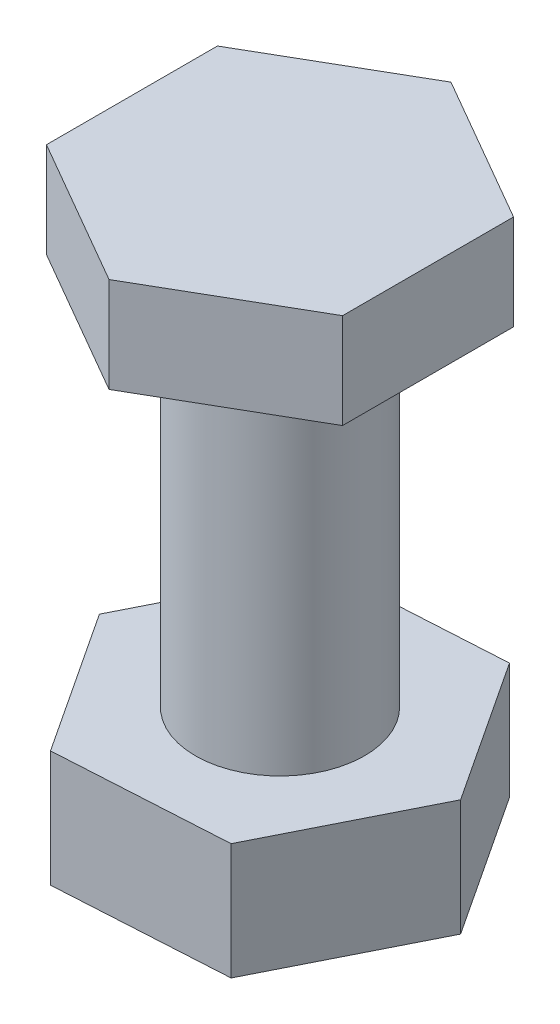
ISO-10303-21;
HEADER;
FILE_DESCRIPTION(('STEP AP214'),'2;1');
FILE_NAME('part.step','',(''),(''),'','','');
FILE_SCHEMA(('AUTOMOTIVE_DESIGN { 1 0 10303 214 1 1 1 1 }'));
ENDSEC;
DATA;
#1=APPLICATION_CONTEXT('core data for automotive mechanical design processes');
#2=APPLICATION_PROTOCOL_DEFINITION('international standard','automotive_design',2000,#1);
#3=PRODUCT_CONTEXT('',#1,'mechanical');
#4=PRODUCT('Part','Part','',(#3));
#5=PRODUCT_RELATED_PRODUCT_CATEGORY('part','',(#4));
#6=PRODUCT_DEFINITION_FORMATION('','',#4);
#7=PRODUCT_DEFINITION_CONTEXT('part definition',#1,'design');
#8=PRODUCT_DEFINITION('design','',#6,#7);
#9=PRODUCT_DEFINITION_SHAPE('','',#8);
#10=(LENGTH_UNIT() NAMED_UNIT(*) SI_UNIT(.MILLI.,.METRE.));
#11=(NAMED_UNIT(*) PLANE_ANGLE_UNIT() SI_UNIT($,.RADIAN.));
#12=(NAMED_UNIT(*) SI_UNIT($,.STERADIAN.) SOLID_ANGLE_UNIT());
#13=UNCERTAINTY_MEASURE_WITH_UNIT(LENGTH_MEASURE(1.E-05),#10,'distance_accuracy_value','');
#14=(GEOMETRIC_REPRESENTATION_CONTEXT(3) GLOBAL_UNCERTAINTY_ASSIGNED_CONTEXT((#13)) GLOBAL_UNIT_ASSIGNED_CONTEXT((#10,
#11,#12)) REPRESENTATION_CONTEXT('',''));
#15=CARTESIAN_POINT('',(0.,0.,0.));
#16=DIRECTION('',(0.,0.,1.));
#17=DIRECTION('',(1.,0.,0.));
#18=AXIS2_PLACEMENT_3D('',#15,#16,#17);
#19=CARTESIAN_POINT('',(0.,17.1,0.));
#20=DIRECTION('',(0.,-1.,0.));
#21=DIRECTION('',(0.,0.,-1.));
#22=AXIS2_PLACEMENT_3D('',#19,#20,#21);
#23=CYLINDRICAL_SURFACE('',#22,3.175);
#24=CARTESIAN_POINT('',(0.,0.,0.));
#25=DIRECTION('',(0.,1.,0.));
#26=DIRECTION('',(0.,0.,1.));
#27=AXIS2_PLACEMENT_3D('',#24,#25,#26);
#28=CIRCLE('',#27,3.175);
#29=CARTESIAN_POINT('',(0.,0.,3.175));
#30=VERTEX_POINT('',#29);
#31=EDGE_CURVE('E50',#30,#30,#28,.T.);
#32=ORIENTED_EDGE('',*,*,#31,.T.);
#33=EDGE_LOOP('',(#32));
#34=FACE_BOUND('',#33,.T.);
#35=CARTESIAN_POINT('',(0.,13.528125,0.));
#36=DIRECTION('',(0.,1.,0.));
#37=DIRECTION('',(0.,0.,1.));
#38=AXIS2_PLACEMENT_3D('',#35,#36,#37);
#39=CIRCLE('',#38,3.175);
#40=CARTESIAN_POINT('',(0.,13.528125,3.175));
#41=VERTEX_POINT('',#40);
#42=EDGE_CURVE('E11',#41,#41,#39,.T.);
#43=ORIENTED_EDGE('',*,*,#42,.F.);
#44=EDGE_LOOP('',(#43));
#45=FACE_BOUND('',#44,.T.);
#46=ADVANCED_FACE('F39',(#34,#45),#23,.T.);
#47=CARTESIAN_POINT('',(2.87936518123152,-4.365625,-5.733394128825));
#48=DIRECTION('',(-0.835483710894783,0.,0.549515212555105));
#49=DIRECTION('',(0.549515212555105,0.,0.835483710894783));
#50=AXIS2_PLACEMENT_3D('',#47,#48,#49);
#51=PLANE('',#50);
#52=DIRECTION('',(0.549515212555105,0.,0.835483710894783));
#53=VECTOR('',#52,1.);
#54=CARTESIAN_POINT('',(2.87936518123152,0.,-5.733394128825));
#55=LINE('',#54,#53);
#56=CARTESIAN_POINT('',(2.87936518123152,0.,-5.733394128825));
#57=VERTEX_POINT('',#56);
#58=CARTESIAN_POINT('',(6.40494755608675,0.,-0.373093670693618));
#59=VERTEX_POINT('',#58);
#60=EDGE_CURVE('E126',#57,#59,#55,.T.);
#61=ORIENTED_EDGE('',*,*,#60,.T.);
#62=DIRECTION('',(0.,1.,0.));
#63=VECTOR('',#62,1.);
#64=CARTESIAN_POINT('',(6.40494755608675,-4.365625,-0.373093670693618));
#65=LINE('',#64,#63);
#66=CARTESIAN_POINT('',(6.40494755608675,-4.365625,-0.373093670693618));
#67=VERTEX_POINT('',#66);
#68=EDGE_CURVE('E148',#67,#59,#65,.T.);
#69=ORIENTED_EDGE('',*,*,#68,.F.);
#70=DIRECTION('',(0.549515212555105,0.,0.835483710894783));
#71=VECTOR('',#70,1.);
#72=CARTESIAN_POINT('',(2.87936518123152,-4.365625,-5.733394128825));
#73=LINE('',#72,#71);
#74=CARTESIAN_POINT('',(2.87936518123152,-4.365625,-5.733394128825));
#75=VERTEX_POINT('',#74);
#76=EDGE_CURVE('E138',#75,#67,#73,.T.);
#77=ORIENTED_EDGE('',*,*,#76,.F.);
#78=DIRECTION('',(0.,1.,0.));
#79=VECTOR('',#78,1.);
#80=CARTESIAN_POINT('',(2.87936518123152,-4.365625,-5.733394128825));
#81=LINE('',#80,#79);
#82=EDGE_CURVE('E123',#75,#57,#81,.T.);
#83=ORIENTED_EDGE('',*,*,#82,.T.);
#84=EDGE_LOOP('',(#61,#69,#77,#83));
#85=FACE_BOUND('',#84,.T.);
#86=ADVANCED_FACE('F161',(#85),#51,.F.);
#87=CARTESIAN_POINT('',(6.40494755608675,-4.365625,-0.373093670693618));
#88=DIRECTION('',(-0.893635989286119,0.,-0.448792511805423));
#89=DIRECTION('',(-0.448792511805423,0.,0.893635989286119));
#90=AXIS2_PLACEMENT_3D('',#87,#88,#89);
#91=PLANE('',#90);
#92=DIRECTION('',(-0.448792511805423,0.,0.893635989286118));
#93=VECTOR('',#92,1.);
#94=CARTESIAN_POINT('',(6.40494755608675,0.,-0.373093670693618));
#95=LINE('',#94,#93);
#96=CARTESIAN_POINT('',(3.52558237485523,0.,5.36030045813138));
#97=VERTEX_POINT('',#96);
#98=EDGE_CURVE('E134',#59,#97,#95,.T.);
#99=ORIENTED_EDGE('',*,*,#98,.T.);
#100=DIRECTION('',(0.,1.,0.));
#101=VECTOR('',#100,1.);
#102=CARTESIAN_POINT('',(3.52558237485523,-4.365625,5.36030045813138));
#103=LINE('',#102,#101);
#104=CARTESIAN_POINT('',(3.52558237485523,-4.365625,5.36030045813138));
#105=VERTEX_POINT('',#104);
#106=EDGE_CURVE('E141',#105,#97,#103,.T.);
#107=ORIENTED_EDGE('',*,*,#106,.F.);
#108=DIRECTION('',(-0.448792511805423,0.,0.893635989286118));
#109=VECTOR('',#108,1.);
#110=CARTESIAN_POINT('',(6.40494755608675,-4.365625,-0.373093670693618));
#111=LINE('',#110,#109);
#112=EDGE_CURVE('E94',#67,#105,#111,.T.);
#113=ORIENTED_EDGE('',*,*,#112,.F.);
#114=ORIENTED_EDGE('',*,*,#68,.T.);
#115=EDGE_LOOP('',(#99,#107,#113,#114));
#116=FACE_BOUND('',#115,.T.);
#117=ADVANCED_FACE('F177',(#116),#91,.F.);
#118=CARTESIAN_POINT('',(3.52558237485523,-4.365625,5.36030045813138));
#119=DIRECTION('',(-0.0581522783913356,0.,-0.998307724360528));
#120=DIRECTION('',(-0.998307724360528,0.,0.0581522783913356));
#121=AXIS2_PLACEMENT_3D('',#118,#119,#120);
#122=PLANE('',#121);
#123=DIRECTION('',(-0.998307724360528,0.,0.0581522783913356));
#124=VECTOR('',#123,1.);
#125=CARTESIAN_POINT('',(3.52558237485523,0.,5.36030045813138));
#126=LINE('',#125,#124);
#127=CARTESIAN_POINT('',(-2.87936518123152,0.,5.733394128825));
#128=VERTEX_POINT('',#127);
#129=EDGE_CURVE('E133',#97,#128,#126,.T.);
#130=ORIENTED_EDGE('',*,*,#129,.T.);
#131=DIRECTION('',(0.,1.,0.));
#132=VECTOR('',#131,1.);
#133=CARTESIAN_POINT('',(-2.87936518123152,-4.365625,5.733394128825));
#134=LINE('',#133,#132);
#135=CARTESIAN_POINT('',(-2.87936518123152,-4.365625,5.733394128825));
#136=VERTEX_POINT('',#135);
#137=EDGE_CURVE('E118',#136,#128,#134,.T.);
#138=ORIENTED_EDGE('',*,*,#137,.F.);
#139=DIRECTION('',(-0.998307724360528,0.,0.0581522783913356));
#140=VECTOR('',#139,1.);
#141=CARTESIAN_POINT('',(3.52558237485523,-4.365625,5.36030045813138));
#142=LINE('',#141,#140);
#143=EDGE_CURVE('E109',#105,#136,#142,.T.);
#144=ORIENTED_EDGE('',*,*,#143,.F.);
#145=ORIENTED_EDGE('',*,*,#106,.T.);
#146=EDGE_LOOP('',(#130,#138,#144,#145));
#147=FACE_BOUND('',#146,.T.);
#148=ADVANCED_FACE('F185',(#147),#122,.F.);
#149=CARTESIAN_POINT('',(-2.87936518123152,-4.365625,5.733394128825));
#150=DIRECTION('',(0.835483710894783,0.,-0.549515212555106));
#151=DIRECTION('',(-0.549515212555106,0.,-0.835483710894783));
#152=AXIS2_PLACEMENT_3D('',#149,#150,#151);
#153=PLANE('',#152);
#154=DIRECTION('',(-0.549515212555106,0.,-0.835483710894783));
#155=VECTOR('',#154,1.);
#156=CARTESIAN_POINT('',(-2.87936518123152,0.,5.733394128825));
#157=LINE('',#156,#155);
#158=CARTESIAN_POINT('',(-6.40494755608676,0.,0.373093670693618));
#159=VERTEX_POINT('',#158);
#160=EDGE_CURVE('E120',#128,#159,#157,.T.);
#161=ORIENTED_EDGE('',*,*,#160,.T.);
#162=DIRECTION('',(0.,1.,0.));
#163=VECTOR('',#162,1.);
#164=CARTESIAN_POINT('',(-6.40494755608676,-4.365625,0.373093670693618));
#165=LINE('',#164,#163);
#166=CARTESIAN_POINT('',(-6.40494755608676,-4.365625,0.373093670693618));
#167=VERTEX_POINT('',#166);
#168=EDGE_CURVE('E113',#167,#159,#165,.T.);
#169=ORIENTED_EDGE('',*,*,#168,.F.);
#170=DIRECTION('',(-0.549515212555106,0.,-0.835483710894783));
#171=VECTOR('',#170,1.);
#172=CARTESIAN_POINT('',(-2.87936518123152,-4.365625,5.733394128825));
#173=LINE('',#172,#171);
#174=EDGE_CURVE('E102',#136,#167,#173,.T.);
#175=ORIENTED_EDGE('',*,*,#174,.F.);
#176=ORIENTED_EDGE('',*,*,#137,.T.);
#177=EDGE_LOOP('',(#161,#169,#175,#176));
#178=FACE_BOUND('',#177,.T.);
#179=ADVANCED_FACE('F119',(#178),#153,.F.);
#180=CARTESIAN_POINT('',(-6.40494755608676,-4.365625,0.373093670693618));
#181=DIRECTION('',(0.893635989286119,0.,0.448792511805423));
#182=DIRECTION('',(0.448792511805423,0.,-0.893635989286119));
#183=AXIS2_PLACEMENT_3D('',#180,#181,#182);
#184=PLANE('',#183);
#185=DIRECTION('',(0.448792511805423,0.,-0.893635989286118));
#186=VECTOR('',#185,1.);
#187=CARTESIAN_POINT('',(-6.40494755608676,0.,0.373093670693618));
#188=LINE('',#187,#186);
#189=CARTESIAN_POINT('',(-3.52558237485524,0.,-5.36030045813138));
#190=VERTEX_POINT('',#189);
#191=EDGE_CURVE('E78',#159,#190,#188,.T.);
#192=ORIENTED_EDGE('',*,*,#191,.T.);
#193=DIRECTION('',(0.,1.,0.));
#194=VECTOR('',#193,1.);
#195=CARTESIAN_POINT('',(-3.52558237485524,-4.365625,-5.36030045813138));
#196=LINE('',#195,#194);
#197=CARTESIAN_POINT('',(-3.52558237485524,-4.365625,-5.36030045813138));
#198=VERTEX_POINT('',#197);
#199=EDGE_CURVE('E117',#198,#190,#196,.T.);
#200=ORIENTED_EDGE('',*,*,#199,.F.);
#201=DIRECTION('',(0.448792511805423,0.,-0.893635989286118));
#202=VECTOR('',#201,1.);
#203=CARTESIAN_POINT('',(-6.40494755608676,-4.365625,0.373093670693618));
#204=LINE('',#203,#202);
#205=EDGE_CURVE('E107',#167,#198,#204,.T.);
#206=ORIENTED_EDGE('',*,*,#205,.F.);
#207=ORIENTED_EDGE('',*,*,#168,.T.);
#208=EDGE_LOOP('',(#192,#200,#206,#207));
#209=FACE_BOUND('',#208,.T.);
#210=ADVANCED_FACE('F122',(#209),#184,.F.);
#211=CARTESIAN_POINT('',(-3.52558237485524,-4.365625,-5.36030045813138));
#212=DIRECTION('',(0.0581522783913359,0.,0.998307724360528));
#213=DIRECTION('',(0.998307724360528,0.,-0.0581522783913359));
#214=AXIS2_PLACEMENT_3D('',#211,#212,#213);
#215=PLANE('',#214);
#216=DIRECTION('',(0.998307724360528,0.,-0.0581522783913359));
#217=VECTOR('',#216,1.);
#218=CARTESIAN_POINT('',(-3.52558237485524,0.,-5.36030045813138));
#219=LINE('',#218,#217);
#220=EDGE_CURVE('E85',#190,#57,#219,.T.);
#221=ORIENTED_EDGE('',*,*,#220,.T.);
#222=ORIENTED_EDGE('',*,*,#82,.F.);
#223=DIRECTION('',(0.998307724360528,0.,-0.0581522783913359));
#224=VECTOR('',#223,1.);
#225=CARTESIAN_POINT('',(-3.52558237485524,-4.365625,-5.36030045813138));
#226=LINE('',#225,#224);
#227=EDGE_CURVE('E54',#198,#75,#226,.T.);
#228=ORIENTED_EDGE('',*,*,#227,.F.);
#229=ORIENTED_EDGE('',*,*,#199,.T.);
#230=EDGE_LOOP('',(#221,#222,#228,#229));
#231=FACE_BOUND('',#230,.T.);
#232=ADVANCED_FACE('F162',(#231),#215,.F.);
#233=CARTESIAN_POINT('',(0.,-4.365625,0.));
#234=DIRECTION('',(0.,-1.,0.));
#235=DIRECTION('',(0.,0.,-1.));
#236=AXIS2_PLACEMENT_3D('',#233,#234,#235);
#237=PLANE('',#236);
#238=ORIENTED_EDGE('',*,*,#76,.T.);
#239=ORIENTED_EDGE('',*,*,#112,.T.);
#240=ORIENTED_EDGE('',*,*,#143,.T.);
#241=ORIENTED_EDGE('',*,*,#174,.T.);
#242=ORIENTED_EDGE('',*,*,#205,.T.);
#243=ORIENTED_EDGE('',*,*,#227,.T.);
#244=EDGE_LOOP('',(#238,#239,#240,#241,#242,#243));
#245=FACE_BOUND('',#244,.T.);
#246=ADVANCED_FACE('F106',(#245),#237,.T.);
#247=CARTESIAN_POINT('',(0.,0.,0.));
#248=DIRECTION('',(0.,-1.,0.));
#249=DIRECTION('',(0.,0.,-1.));
#250=AXIS2_PLACEMENT_3D('',#247,#248,#249);
#251=PLANE('',#250);
#252=ORIENTED_EDGE('',*,*,#31,.F.);
#253=EDGE_LOOP('',(#252));
#254=FACE_BOUND('',#253,.T.);
#255=ORIENTED_EDGE('',*,*,#60,.F.);
#256=ORIENTED_EDGE('',*,*,#220,.F.);
#257=ORIENTED_EDGE('',*,*,#191,.F.);
#258=ORIENTED_EDGE('',*,*,#160,.F.);
#259=ORIENTED_EDGE('',*,*,#129,.F.);
#260=ORIENTED_EDGE('',*,*,#98,.F.);
#261=EDGE_LOOP('',(#255,#256,#257,#258,#259,#260));
#262=FACE_BOUND('',#261,.T.);
#263=ADVANCED_FACE('F155',(#254,#262),#251,.F.);
#264=CARTESIAN_POINT('',(5.55625,13.528125,-3.20790243318486));
#265=DIRECTION('',(0.5,0.,-0.866025403784439));
#266=DIRECTION('',(-0.866025403784439,0.,-0.5));
#267=AXIS2_PLACEMENT_3D('',#264,#265,#266);
#268=PLANE('',#267);
#269=DIRECTION('',(-0.866025403784438,0.,-0.5));
#270=VECTOR('',#269,1.);
#271=CARTESIAN_POINT('',(5.55625,17.1,-3.20790243318486));
#272=LINE('',#271,#270);
#273=CARTESIAN_POINT('',(5.55625,17.1,-3.20790243318486));
#274=VERTEX_POINT('',#273);
#275=CARTESIAN_POINT('',(0.,17.1,-6.41580486636972));
#276=VERTEX_POINT('',#275);
#277=EDGE_CURVE('E199',#274,#276,#272,.T.);
#278=ORIENTED_EDGE('',*,*,#277,.F.);
#279=DIRECTION('',(0.,1.,0.));
#280=VECTOR('',#279,1.);
#281=CARTESIAN_POINT('',(5.55625,13.528125,-3.20790243318486));
#282=LINE('',#281,#280);
#283=CARTESIAN_POINT('',(5.55625,13.528125,-3.20790243318486));
#284=VERTEX_POINT('',#283);
#285=EDGE_CURVE('E131',#284,#274,#282,.T.);
#286=ORIENTED_EDGE('',*,*,#285,.F.);
#287=DIRECTION('',(-0.866025403784438,0.,-0.5));
#288=VECTOR('',#287,1.);
#289=CARTESIAN_POINT('',(5.55625,13.528125,-3.20790243318486));
#290=LINE('',#289,#288);
#291=CARTESIAN_POINT('',(0.,13.528125,-6.41580486636972));
#292=VERTEX_POINT('',#291);
#293=EDGE_CURVE('E229',#284,#292,#290,.T.);
#294=ORIENTED_EDGE('',*,*,#293,.T.);
#295=DIRECTION('',(0.,1.,0.));
#296=VECTOR('',#295,1.);
#297=CARTESIAN_POINT('',(0.,13.528125,-6.41580486636972));
#298=LINE('',#297,#296);
#299=EDGE_CURVE('E244',#292,#276,#298,.T.);
#300=ORIENTED_EDGE('',*,*,#299,.T.);
#301=EDGE_LOOP('',(#278,#286,#294,#300));
#302=FACE_BOUND('',#301,.T.);
#303=ADVANCED_FACE('F154',(#302),#268,.T.);
#304=CARTESIAN_POINT('',(5.55625,13.528125,3.20790243318486));
#305=DIRECTION('',(1.,0.,0.));
#306=DIRECTION('',(0.,0.,-1.));
#307=AXIS2_PLACEMENT_3D('',#304,#305,#306);
#308=PLANE('',#307);
#309=DIRECTION('',(0.,0.,-1.));
#310=VECTOR('',#309,1.);
#311=CARTESIAN_POINT('',(5.55625,17.1,3.20790243318486));
#312=LINE('',#311,#310);
#313=CARTESIAN_POINT('',(5.55625,17.1,3.20790243318486));
#314=VERTEX_POINT('',#313);
#315=EDGE_CURVE('E210',#314,#274,#312,.T.);
#316=ORIENTED_EDGE('',*,*,#315,.F.);
#317=DIRECTION('',(0.,1.,0.));
#318=VECTOR('',#317,1.);
#319=CARTESIAN_POINT('',(5.55625,13.528125,3.20790243318486));
#320=LINE('',#319,#318);
#321=CARTESIAN_POINT('',(5.55625,13.528125,3.20790243318486));
#322=VERTEX_POINT('',#321);
#323=EDGE_CURVE('E228',#322,#314,#320,.T.);
#324=ORIENTED_EDGE('',*,*,#323,.F.);
#325=DIRECTION('',(0.,0.,-1.));
#326=VECTOR('',#325,1.);
#327=CARTESIAN_POINT('',(5.55625,13.528125,3.20790243318486));
#328=LINE('',#327,#326);
#329=EDGE_CURVE('E216',#322,#284,#328,.T.);
#330=ORIENTED_EDGE('',*,*,#329,.T.);
#331=ORIENTED_EDGE('',*,*,#285,.T.);
#332=EDGE_LOOP('',(#316,#324,#330,#331));
#333=FACE_BOUND('',#332,.T.);
#334=ADVANCED_FACE('F286',(#333),#308,.T.);
#335=CARTESIAN_POINT('',(0.,13.528125,6.41580486636972));
#336=DIRECTION('',(0.5,0.,0.866025403784439));
#337=DIRECTION('',(0.866025403784439,0.,-0.5));
#338=AXIS2_PLACEMENT_3D('',#335,#336,#337);
#339=PLANE('',#338);
#340=DIRECTION('',(0.866025403784439,0.,-0.5));
#341=VECTOR('',#340,1.);
#342=CARTESIAN_POINT('',(0.,17.1,6.41580486636972));
#343=LINE('',#342,#341);
#344=CARTESIAN_POINT('',(0.,17.1,6.41580486636972));
#345=VERTEX_POINT('',#344);
#346=EDGE_CURVE('E224',#345,#314,#343,.T.);
#347=ORIENTED_EDGE('',*,*,#346,.F.);
#348=DIRECTION('',(0.,1.,0.));
#349=VECTOR('',#348,1.);
#350=CARTESIAN_POINT('',(0.,13.528125,6.41580486636972));
#351=LINE('',#350,#349);
#352=CARTESIAN_POINT('',(0.,13.528125,6.41580486636972));
#353=VERTEX_POINT('',#352);
#354=EDGE_CURVE('E232',#353,#345,#351,.T.);
#355=ORIENTED_EDGE('',*,*,#354,.F.);
#356=DIRECTION('',(0.866025403784439,0.,-0.5));
#357=VECTOR('',#356,1.);
#358=CARTESIAN_POINT('',(0.,13.528125,6.41580486636972));
#359=LINE('',#358,#357);
#360=EDGE_CURVE('E401',#353,#322,#359,.T.);
#361=ORIENTED_EDGE('',*,*,#360,.T.);
#362=ORIENTED_EDGE('',*,*,#323,.T.);
#363=EDGE_LOOP('',(#347,#355,#361,#362));
#364=FACE_BOUND('',#363,.T.);
#365=ADVANCED_FACE('F293',(#364),#339,.T.);
#366=CARTESIAN_POINT('',(-5.55625,13.528125,3.20790243318486));
#367=DIRECTION('',(-0.5,0.,0.866025403784439));
#368=DIRECTION('',(0.866025403784439,0.,0.5));
#369=AXIS2_PLACEMENT_3D('',#366,#367,#368);
#370=PLANE('',#369);
#371=DIRECTION('',(0.866025403784439,0.,0.5));
#372=VECTOR('',#371,1.);
#373=CARTESIAN_POINT('',(-5.55625,17.1,3.20790243318486));
#374=LINE('',#373,#372);
#375=CARTESIAN_POINT('',(-5.55625,17.1,3.20790243318486));
#376=VERTEX_POINT('',#375);
#377=EDGE_CURVE('E219',#376,#345,#374,.T.);
#378=ORIENTED_EDGE('',*,*,#377,.F.);
#379=DIRECTION('',(0.,1.,0.));
#380=VECTOR('',#379,1.);
#381=CARTESIAN_POINT('',(-5.55625,13.528125,3.20790243318486));
#382=LINE('',#381,#380);
#383=CARTESIAN_POINT('',(-5.55625,13.528125,3.20790243318486));
#384=VERTEX_POINT('',#383);
#385=EDGE_CURVE('E235',#384,#376,#382,.T.);
#386=ORIENTED_EDGE('',*,*,#385,.F.);
#387=DIRECTION('',(0.866025403784439,0.,0.5));
#388=VECTOR('',#387,1.);
#389=CARTESIAN_POINT('',(-5.55625,13.528125,3.20790243318486));
#390=LINE('',#389,#388);
#391=EDGE_CURVE('E404',#384,#353,#390,.T.);
#392=ORIENTED_EDGE('',*,*,#391,.T.);
#393=ORIENTED_EDGE('',*,*,#354,.T.);
#394=EDGE_LOOP('',(#378,#386,#392,#393));
#395=FACE_BOUND('',#394,.T.);
#396=ADVANCED_FACE('F305',(#395),#370,.T.);
#397=CARTESIAN_POINT('',(-5.55625,13.528125,-3.20790243318486));
#398=DIRECTION('',(-1.,0.,0.));
#399=DIRECTION('',(0.,0.,1.));
#400=AXIS2_PLACEMENT_3D('',#397,#398,#399);
#401=PLANE('',#400);
#402=DIRECTION('',(0.,0.,1.));
#403=VECTOR('',#402,1.);
#404=CARTESIAN_POINT('',(-5.55625,17.1,-3.20790243318486));
#405=LINE('',#404,#403);
#406=CARTESIAN_POINT('',(-5.55625,17.1,-3.20790243318486));
#407=VERTEX_POINT('',#406);
#408=EDGE_CURVE('E213',#407,#376,#405,.T.);
#409=ORIENTED_EDGE('',*,*,#408,.F.);
#410=DIRECTION('',(0.,1.,0.));
#411=VECTOR('',#410,1.);
#412=CARTESIAN_POINT('',(-5.55625,13.528125,-3.20790243318486));
#413=LINE('',#412,#411);
#414=CARTESIAN_POINT('',(-5.55625,13.528125,-3.20790243318486));
#415=VERTEX_POINT('',#414);
#416=EDGE_CURVE('E236',#415,#407,#413,.T.);
#417=ORIENTED_EDGE('',*,*,#416,.F.);
#418=DIRECTION('',(0.,0.,1.));
#419=VECTOR('',#418,1.);
#420=CARTESIAN_POINT('',(-5.55625,13.528125,-3.20790243318486));
#421=LINE('',#420,#419);
#422=EDGE_CURVE('E409',#415,#384,#421,.T.);
#423=ORIENTED_EDGE('',*,*,#422,.T.);
#424=ORIENTED_EDGE('',*,*,#385,.T.);
#425=EDGE_LOOP('',(#409,#417,#423,#424));
#426=FACE_BOUND('',#425,.T.);
#427=ADVANCED_FACE('F312',(#426),#401,.T.);
#428=CARTESIAN_POINT('',(0.,13.528125,-6.41580486636972));
#429=DIRECTION('',(-0.5,0.,-0.866025403784439));
#430=DIRECTION('',(-0.866025403784439,0.,0.5));
#431=AXIS2_PLACEMENT_3D('',#428,#429,#430);
#432=PLANE('',#431);
#433=DIRECTION('',(-0.866025403784439,0.,0.5));
#434=VECTOR('',#433,1.);
#435=CARTESIAN_POINT('',(0.,17.1,-6.41580486636972));
#436=LINE('',#435,#434);
#437=EDGE_CURVE('E204',#276,#407,#436,.T.);
#438=ORIENTED_EDGE('',*,*,#437,.F.);
#439=ORIENTED_EDGE('',*,*,#299,.F.);
#440=DIRECTION('',(-0.866025403784439,0.,0.5));
#441=VECTOR('',#440,1.);
#442=CARTESIAN_POINT('',(0.,13.528125,-6.41580486636972));
#443=LINE('',#442,#441);
#444=EDGE_CURVE('E375',#292,#415,#443,.T.);
#445=ORIENTED_EDGE('',*,*,#444,.T.);
#446=ORIENTED_EDGE('',*,*,#416,.T.);
#447=EDGE_LOOP('',(#438,#439,#445,#446));
#448=FACE_BOUND('',#447,.T.);
#449=ADVANCED_FACE('F192',(#448),#432,.T.);
#450=CARTESIAN_POINT('',(0.,13.528125,0.));
#451=DIRECTION('',(0.,1.,0.));
#452=DIRECTION('',(0.,0.,1.));
#453=AXIS2_PLACEMENT_3D('',#450,#451,#452);
#454=PLANE('',#453);
#455=ORIENTED_EDGE('',*,*,#42,.T.);
#456=EDGE_LOOP('',(#455));
#457=FACE_BOUND('',#456,.T.);
#458=ORIENTED_EDGE('',*,*,#293,.F.);
#459=ORIENTED_EDGE('',*,*,#329,.F.);
#460=ORIENTED_EDGE('',*,*,#360,.F.);
#461=ORIENTED_EDGE('',*,*,#391,.F.);
#462=ORIENTED_EDGE('',*,*,#422,.F.);
#463=ORIENTED_EDGE('',*,*,#444,.F.);
#464=EDGE_LOOP('',(#458,#459,#460,#461,#462,#463));
#465=FACE_BOUND('',#464,.T.);
#466=ADVANCED_FACE('F186',(#457,#465),#454,.F.);
#467=CARTESIAN_POINT('',(0.,17.1,0.));
#468=DIRECTION('',(0.,1.,0.));
#469=DIRECTION('',(0.,0.,1.));
#470=AXIS2_PLACEMENT_3D('',#467,#468,#469);
#471=PLANE('',#470);
#472=ORIENTED_EDGE('',*,*,#277,.T.);
#473=ORIENTED_EDGE('',*,*,#437,.T.);
#474=ORIENTED_EDGE('',*,*,#408,.T.);
#475=ORIENTED_EDGE('',*,*,#377,.T.);
#476=ORIENTED_EDGE('',*,*,#346,.T.);
#477=ORIENTED_EDGE('',*,*,#315,.T.);
#478=EDGE_LOOP('',(#472,#473,#474,#475,#476,#477));
#479=FACE_BOUND('',#478,.T.);
#480=ADVANCED_FACE('F183',(#479),#471,.T.);
#481=CLOSED_SHELL('',(#46,#86,#117,#148,#179,#210,#232,#246,#263,#303,#334,#365,#396,#427,#449,
#466,#480));
#482=MANIFOLD_SOLID_BREP('B2',#481);
#483=ADVANCED_BREP_SHAPE_REPRESENTATION('',(#18,#482),#14);
#484=SHAPE_DEFINITION_REPRESENTATION(#9,#483);
ENDSEC;
END-ISO-10303-21;
